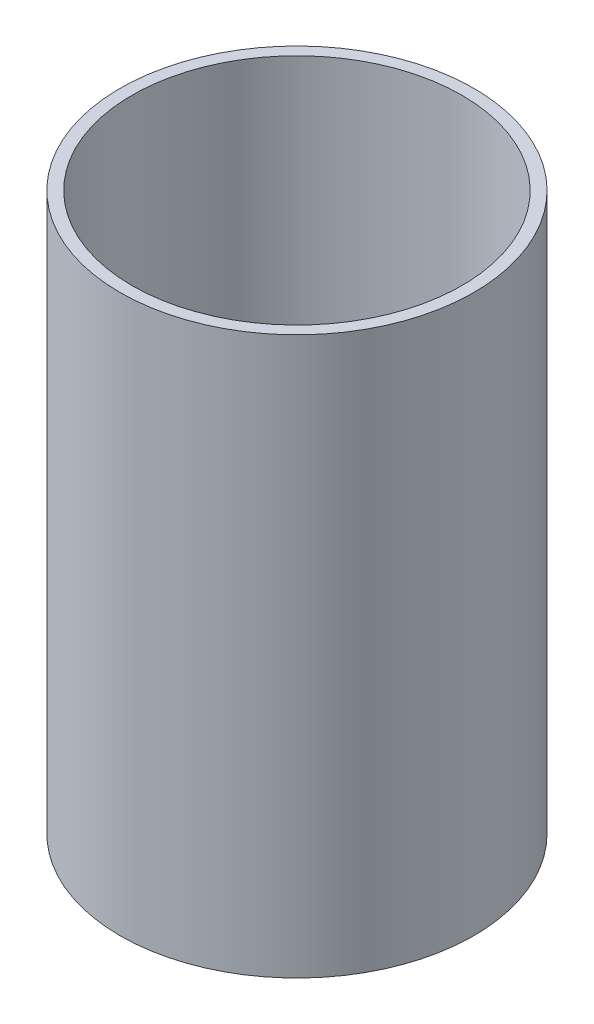
ISO-10303-21;
HEADER;
FILE_DESCRIPTION(('STEP AP214'),'2;1');
FILE_NAME('part.step','',(''),(''),'','','');
FILE_SCHEMA(('AUTOMOTIVE_DESIGN { 1 0 10303 214 1 1 1 1 }'));
ENDSEC;
DATA;
#1=APPLICATION_CONTEXT('core data for automotive mechanical design processes');
#2=APPLICATION_PROTOCOL_DEFINITION('international standard','automotive_design',2000,#1);
#3=PRODUCT_CONTEXT('',#1,'mechanical');
#4=PRODUCT('Part','Part','',(#3));
#5=PRODUCT_RELATED_PRODUCT_CATEGORY('part','',(#4));
#6=PRODUCT_DEFINITION_FORMATION('','',#4);
#7=PRODUCT_DEFINITION_CONTEXT('part definition',#1,'design');
#8=PRODUCT_DEFINITION('design','',#6,#7);
#9=PRODUCT_DEFINITION_SHAPE('','',#8);
#10=(LENGTH_UNIT() NAMED_UNIT(*) SI_UNIT(.MILLI.,.METRE.));
#11=(NAMED_UNIT(*) PLANE_ANGLE_UNIT() SI_UNIT($,.RADIAN.));
#12=(NAMED_UNIT(*) SI_UNIT($,.STERADIAN.) SOLID_ANGLE_UNIT());
#13=UNCERTAINTY_MEASURE_WITH_UNIT(LENGTH_MEASURE(1.E-05),#10,'distance_accuracy_value','');
#14=(GEOMETRIC_REPRESENTATION_CONTEXT(3) GLOBAL_UNCERTAINTY_ASSIGNED_CONTEXT((#13)) GLOBAL_UNIT_ASSIGNED_CONTEXT((#10,
#11,#12)) REPRESENTATION_CONTEXT('',''));
#15=CARTESIAN_POINT('',(0.,0.,0.));
#16=DIRECTION('',(0.,0.,1.));
#17=DIRECTION('',(1.,0.,0.));
#18=AXIS2_PLACEMENT_3D('',#15,#16,#17);
#19=CARTESIAN_POINT('',(0.,140.,0.));
#20=DIRECTION('',(0.,1.,0.));
#21=DIRECTION('',(0.,0.,1.));
#22=AXIS2_PLACEMENT_3D('',#19,#20,#21);
#23=PLANE('',#22);
#24=CARTESIAN_POINT('',(0.,140.,0.));
#25=DIRECTION('',(0.,1.,0.));
#26=DIRECTION('',(0.,0.,1.));
#27=AXIS2_PLACEMENT_3D('',#24,#25,#26);
#28=CIRCLE('',#27,44.45);
#29=CARTESIAN_POINT('',(0.,140.,44.45));
#30=VERTEX_POINT('',#29);
#31=EDGE_CURVE('E10',#30,#30,#28,.T.);
#32=ORIENTED_EDGE('',*,*,#31,.T.);
#33=EDGE_LOOP('',(#32));
#34=FACE_BOUND('',#33,.T.);
#35=CARTESIAN_POINT('',(0.,140.,0.));
#36=DIRECTION('',(0.,1.,0.));
#37=DIRECTION('',(0.,0.,1.));
#38=AXIS2_PLACEMENT_3D('',#35,#36,#37);
#39=CIRCLE('',#38,41.45);
#40=CARTESIAN_POINT('',(0.,140.,41.45));
#41=VERTEX_POINT('',#40);
#42=EDGE_CURVE('E42',#41,#41,#39,.T.);
#43=ORIENTED_EDGE('',*,*,#42,.F.);
#44=EDGE_LOOP('',(#43));
#45=FACE_BOUND('',#44,.T.);
#46=ADVANCED_FACE('F31',(#34,#45),#23,.T.);
#47=CARTESIAN_POINT('',(0.,0.,0.));
#48=DIRECTION('',(0.,1.,0.));
#49=DIRECTION('',(0.,0.,1.));
#50=AXIS2_PLACEMENT_3D('',#47,#48,#49);
#51=PLANE('',#50);
#52=CARTESIAN_POINT('',(0.,0.,0.));
#53=DIRECTION('',(0.,1.,0.));
#54=DIRECTION('',(0.,0.,1.));
#55=AXIS2_PLACEMENT_3D('',#52,#53,#54);
#56=CIRCLE('',#55,44.45);
#57=CARTESIAN_POINT('',(0.,0.,44.45));
#58=VERTEX_POINT('',#57);
#59=EDGE_CURVE('E35',#58,#58,#56,.T.);
#60=ORIENTED_EDGE('',*,*,#59,.F.);
#61=EDGE_LOOP('',(#60));
#62=FACE_BOUND('',#61,.T.);
#63=CARTESIAN_POINT('',(0.,0.,0.));
#64=DIRECTION('',(0.,1.,0.));
#65=DIRECTION('',(0.,0.,1.));
#66=AXIS2_PLACEMENT_3D('',#63,#64,#65);
#67=CIRCLE('',#66,41.45);
#68=CARTESIAN_POINT('',(0.,0.,41.45));
#69=VERTEX_POINT('',#68);
#70=EDGE_CURVE('E44',#69,#69,#67,.T.);
#71=ORIENTED_EDGE('',*,*,#70,.T.);
#72=EDGE_LOOP('',(#71));
#73=FACE_BOUND('',#72,.T.);
#74=ADVANCED_FACE('F54',(#62,#73),#51,.F.);
#75=CARTESIAN_POINT('',(0.,140.,0.));
#76=DIRECTION('',(0.,-1.,0.));
#77=DIRECTION('',(0.,0.,-1.));
#78=AXIS2_PLACEMENT_3D('',#75,#76,#77);
#79=CYLINDRICAL_SURFACE('',#78,44.45);
#80=ORIENTED_EDGE('',*,*,#31,.F.);
#81=EDGE_LOOP('',(#80));
#82=FACE_BOUND('',#81,.T.);
#83=ORIENTED_EDGE('',*,*,#59,.T.);
#84=EDGE_LOOP('',(#83));
#85=FACE_BOUND('',#84,.T.);
#86=ADVANCED_FACE('F33',(#82,#85),#79,.T.);
#87=CARTESIAN_POINT('',(0.,140.,0.));
#88=DIRECTION('',(0.,-1.,0.));
#89=DIRECTION('',(0.,0.,-1.));
#90=AXIS2_PLACEMENT_3D('',#87,#88,#89);
#91=CYLINDRICAL_SURFACE('',#90,41.45);
#92=ORIENTED_EDGE('',*,*,#42,.T.);
#93=EDGE_LOOP('',(#92));
#94=FACE_BOUND('',#93,.T.);
#95=ORIENTED_EDGE('',*,*,#70,.F.);
#96=EDGE_LOOP('',(#95));
#97=FACE_BOUND('',#96,.T.);
#98=ADVANCED_FACE('F50',(#94,#97),#91,.F.);
#99=CLOSED_SHELL('',(#46,#74,#86,#98));
#100=MANIFOLD_SOLID_BREP('B2',#99);
#101=ADVANCED_BREP_SHAPE_REPRESENTATION('',(#18,#100),#14);
#102=SHAPE_DEFINITION_REPRESENTATION(#9,#101);
ENDSEC;
END-ISO-10303-21;
